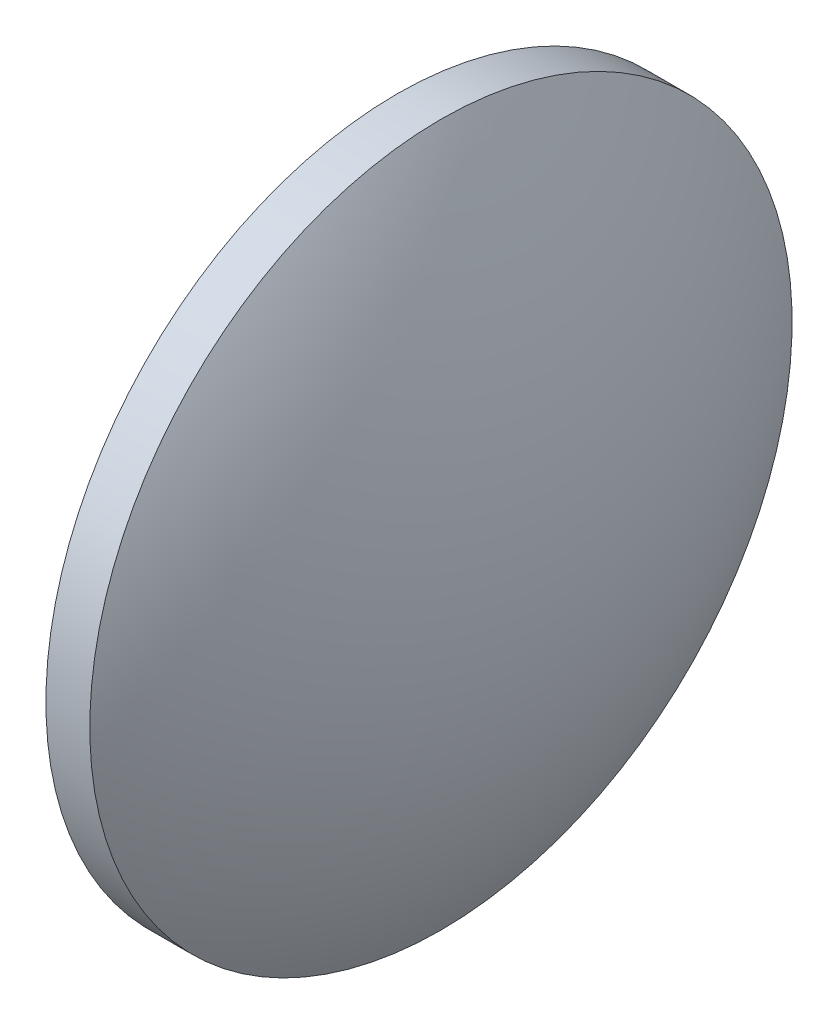
ISO-10303-21;
HEADER;
FILE_DESCRIPTION(('STEP AP214'),'2;1');
FILE_NAME('part.step','',(''),(''),'','','');
FILE_SCHEMA(('AUTOMOTIVE_DESIGN { 1 0 10303 214 1 1 1 1 }'));
ENDSEC;
DATA;
#1=APPLICATION_CONTEXT('core data for automotive mechanical design processes');
#2=APPLICATION_PROTOCOL_DEFINITION('international standard','automotive_design',2000,#1);
#3=PRODUCT_CONTEXT('',#1,'mechanical');
#4=PRODUCT('Part','Part','',(#3));
#5=PRODUCT_RELATED_PRODUCT_CATEGORY('part','',(#4));
#6=PRODUCT_DEFINITION_FORMATION('','',#4);
#7=PRODUCT_DEFINITION_CONTEXT('part definition',#1,'design');
#8=PRODUCT_DEFINITION('design','',#6,#7);
#9=PRODUCT_DEFINITION_SHAPE('','',#8);
#10=(LENGTH_UNIT() NAMED_UNIT(*) SI_UNIT(.MILLI.,.METRE.));
#11=(NAMED_UNIT(*) PLANE_ANGLE_UNIT() SI_UNIT($,.RADIAN.));
#12=(NAMED_UNIT(*) SI_UNIT($,.STERADIAN.) SOLID_ANGLE_UNIT());
#13=UNCERTAINTY_MEASURE_WITH_UNIT(LENGTH_MEASURE(1.E-05),#10,'distance_accuracy_value','');
#14=(GEOMETRIC_REPRESENTATION_CONTEXT(3) GLOBAL_UNCERTAINTY_ASSIGNED_CONTEXT((#13)) GLOBAL_UNIT_ASSIGNED_CONTEXT((#10,
#11,#12)) REPRESENTATION_CONTEXT('',''));
#15=CARTESIAN_POINT('',(0.,0.,0.));
#16=DIRECTION('',(0.,0.,1.));
#17=DIRECTION('',(1.,0.,0.));
#18=AXIS2_PLACEMENT_3D('',#15,#16,#17);
#19=CARTESIAN_POINT('',(168.200666073004,76.5608079105269,0.));
#20=DIRECTION('',(-1.,0.,0.));
#21=DIRECTION('',(0.,1.,0.));
#22=AXIS2_PLACEMENT_3D('',#19,#20,#21);
#23=SPHERICAL_SURFACE('',#22,38.8410302073938);
#24=CARTESIAN_POINT('',(134.90463586561,76.5608079105269,0.));
#25=DIRECTION('',(-1.,0.,0.));
#26=DIRECTION('',(0.,-1.,0.));
#27=AXIS2_PLACEMENT_3D('',#24,#25,#26);
#28=CIRCLE('',#27,20.);
#29=CARTESIAN_POINT('',(134.90463586561,56.5608079105269,0.));
#30=VERTEX_POINT('',#29);
#31=EDGE_CURVE('E41',#30,#30,#28,.T.);
#32=ORIENTED_EDGE('',*,*,#31,.T.);
#33=EDGE_LOOP('',(#32));
#34=FACE_BOUND('',#33,.T.);
#35=ADVANCED_FACE('F35',(#34),#23,.T.);
#36=CARTESIAN_POINT('',(104.108605658216,76.5608079105268,0.));
#37=DIRECTION('',(-1.,0.,0.));
#38=DIRECTION('',(0.,1.,0.));
#39=AXIS2_PLACEMENT_3D('',#36,#37,#38);
#40=SPHERICAL_SURFACE('',#39,38.8410302073941);
#41=CARTESIAN_POINT('',(137.40463586561,76.5608079105269,0.));
#42=DIRECTION('',(-1.,0.,0.));
#43=DIRECTION('',(0.,-1.,0.));
#44=AXIS2_PLACEMENT_3D('',#41,#42,#43);
#45=CIRCLE('',#44,19.9999999999999);
#46=CARTESIAN_POINT('',(137.40463586561,56.5608079105269,0.));
#47=VERTEX_POINT('',#46);
#48=EDGE_CURVE('E10',#47,#47,#45,.T.);
#49=ORIENTED_EDGE('',*,*,#48,.F.);
#50=EDGE_LOOP('',(#49));
#51=FACE_BOUND('',#50,.T.);
#52=ADVANCED_FACE('F50',(#51),#40,.T.);
#53=CARTESIAN_POINT('',(104.108605658216,76.5608079105268,0.));
#54=DIRECTION('',(-1.,0.,0.));
#55=DIRECTION('',(0.,-1.,0.));
#56=AXIS2_PLACEMENT_3D('',#53,#54,#55);
#57=CYLINDRICAL_SURFACE('',#56,19.9999999999999);
#58=ORIENTED_EDGE('',*,*,#48,.T.);
#59=EDGE_LOOP('',(#58));
#60=FACE_BOUND('',#59,.T.);
#61=ORIENTED_EDGE('',*,*,#31,.F.);
#62=EDGE_LOOP('',(#61));
#63=FACE_BOUND('',#62,.T.);
#64=ADVANCED_FACE('F48',(#60,#63),#57,.T.);
#65=CLOSED_SHELL('',(#35,#52,#64));
#66=MANIFOLD_SOLID_BREP('B2',#65);
#67=ADVANCED_BREP_SHAPE_REPRESENTATION('',(#18,#66),#14);
#68=SHAPE_DEFINITION_REPRESENTATION(#9,#67);
ENDSEC;
END-ISO-10303-21;
